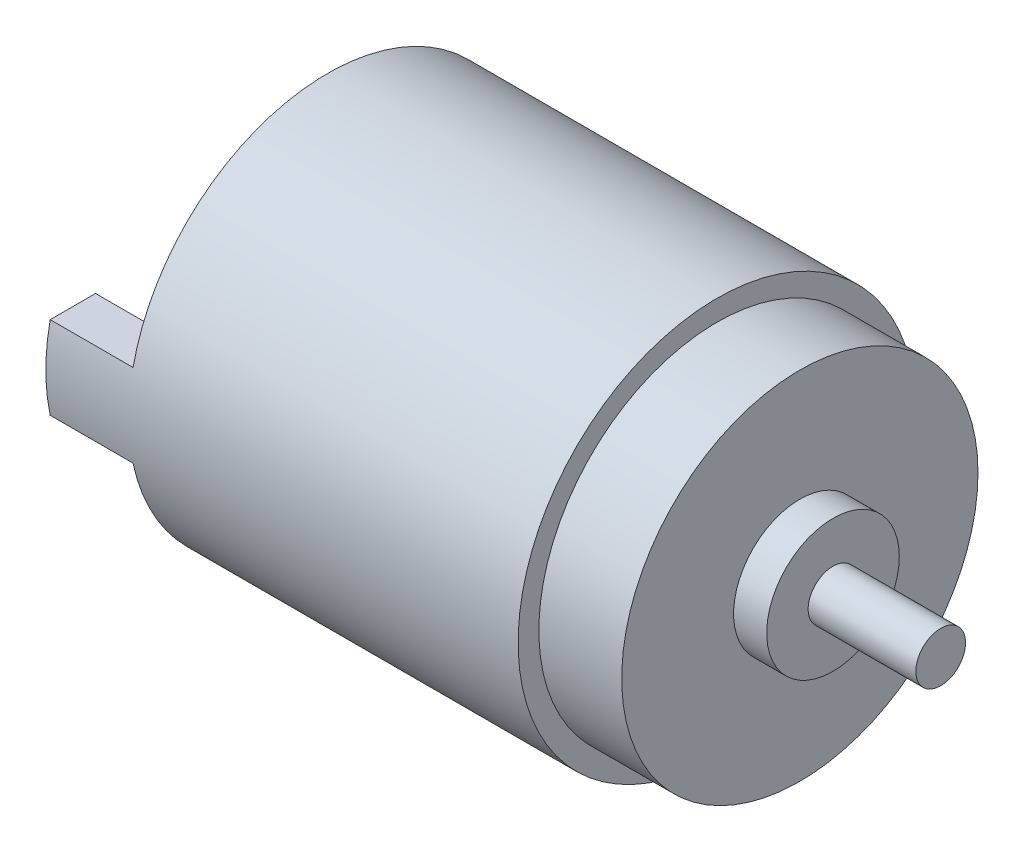
ISO-10303-21;
HEADER;
FILE_DESCRIPTION(('STEP AP214'),'2;1');
FILE_NAME('part.step','',(''),(''),'','','');
FILE_SCHEMA(('AUTOMOTIVE_DESIGN { 1 0 10303 214 1 1 1 1 }'));
ENDSEC;
DATA;
#1=APPLICATION_CONTEXT('core data for automotive mechanical design processes');
#2=APPLICATION_PROTOCOL_DEFINITION('international standard','automotive_design',2000,#1);
#3=PRODUCT_CONTEXT('',#1,'mechanical');
#4=PRODUCT('Part','Part','',(#3));
#5=PRODUCT_RELATED_PRODUCT_CATEGORY('part','',(#4));
#6=PRODUCT_DEFINITION_FORMATION('','',#4);
#7=PRODUCT_DEFINITION_CONTEXT('part definition',#1,'design');
#8=PRODUCT_DEFINITION('design','',#6,#7);
#9=PRODUCT_DEFINITION_SHAPE('','',#8);
#10=(LENGTH_UNIT() NAMED_UNIT(*) SI_UNIT(.MILLI.,.METRE.));
#11=(NAMED_UNIT(*) PLANE_ANGLE_UNIT() SI_UNIT($,.RADIAN.));
#12=(NAMED_UNIT(*) SI_UNIT($,.STERADIAN.) SOLID_ANGLE_UNIT());
#13=UNCERTAINTY_MEASURE_WITH_UNIT(LENGTH_MEASURE(1.E-05),#10,'distance_accuracy_value','');
#14=(GEOMETRIC_REPRESENTATION_CONTEXT(3) GLOBAL_UNCERTAINTY_ASSIGNED_CONTEXT((#13)) GLOBAL_UNIT_ASSIGNED_CONTEXT((#10,
#11,#12)) REPRESENTATION_CONTEXT('',''));
#15=CARTESIAN_POINT('',(0.,0.,0.));
#16=DIRECTION('',(0.,0.,1.));
#17=DIRECTION('',(1.,0.,0.));
#18=AXIS2_PLACEMENT_3D('',#15,#16,#17);
#19=CARTESIAN_POINT('',(0.,0.,0.));
#20=DIRECTION('',(1.,0.,0.));
#21=DIRECTION('',(0.,0.,-1.));
#22=AXIS2_PLACEMENT_3D('',#19,#20,#21);
#23=PLANE('',#22);
#24=CARTESIAN_POINT('',(0.,0.,0.));
#25=DIRECTION('',(-1.,0.,0.));
#26=DIRECTION('',(0.,0.,1.));
#27=AXIS2_PLACEMENT_3D('',#24,#25,#26);
#28=CIRCLE('',#27,4.5);
#29=CARTESIAN_POINT('',(0.,-4.,2.06155281280883));
#30=VERTEX_POINT('',#29);
#31=CARTESIAN_POINT('',(0.,-4.,-2.06155281280883));
#32=VERTEX_POINT('',#31);
#33=EDGE_CURVE('E182',#30,#32,#28,.T.);
#34=ORIENTED_EDGE('',*,*,#33,.F.);
#35=DIRECTION('',(0.,0.,1.));
#36=VECTOR('',#35,1.);
#37=CARTESIAN_POINT('',(0.,-4.,-2.06155281280883));
#38=LINE('',#37,#36);
#39=EDGE_CURVE('E187',#32,#30,#38,.T.);
#40=ORIENTED_EDGE('',*,*,#39,.F.);
#41=EDGE_LOOP('',(#34,#40));
#42=FACE_BOUND('',#41,.T.);
#43=DIRECTION('',(0.,0.,-1.));
#44=VECTOR('',#43,1.);
#45=CARTESIAN_POINT('',(0.,2.5,0.));
#46=LINE('',#45,#44);
#47=CARTESIAN_POINT('',(0.,2.5,-9.));
#48=VERTEX_POINT('',#47);
#49=CARTESIAN_POINT('',(0.,2.5,-11.7366945943055));
#50=VERTEX_POINT('',#49);
#51=EDGE_CURVE('E57',#48,#50,#46,.T.);
#52=ORIENTED_EDGE('',*,*,#51,.F.);
#53=DIRECTION('',(0.,-1.,0.));
#54=VECTOR('',#53,1.);
#55=CARTESIAN_POINT('',(0.,0.,-9.));
#56=LINE('',#55,#54);
#57=CARTESIAN_POINT('',(0.,-2.5,-9.));
#58=VERTEX_POINT('',#57);
#59=EDGE_CURVE('E129',#48,#58,#56,.T.);
#60=ORIENTED_EDGE('',*,*,#59,.T.);
#61=DIRECTION('',(0.,0.,-1.));
#62=VECTOR('',#61,1.);
#63=CARTESIAN_POINT('',(0.,-2.5,0.));
#64=LINE('',#63,#62);
#65=CARTESIAN_POINT('',(0.,-2.5,-11.7366945943055));
#66=VERTEX_POINT('',#65);
#67=EDGE_CURVE('E143',#58,#66,#64,.T.);
#68=ORIENTED_EDGE('',*,*,#67,.T.);
#69=CARTESIAN_POINT('',(0.,0.,0.));
#70=DIRECTION('',(1.,0.,0.));
#71=DIRECTION('',(0.,0.,-1.));
#72=AXIS2_PLACEMENT_3D('',#69,#70,#71);
#73=CIRCLE('',#72,12.);
#74=CARTESIAN_POINT('',(0.,-2.5,11.7366945943055));
#75=VERTEX_POINT('',#74);
#76=EDGE_CURVE('E49',#75,#66,#73,.T.);
#77=ORIENTED_EDGE('',*,*,#76,.F.);
#78=DIRECTION('',(0.,0.,1.));
#79=VECTOR('',#78,1.);
#80=CARTESIAN_POINT('',(0.,-2.5,0.));
#81=LINE('',#80,#79);
#82=CARTESIAN_POINT('',(0.,-2.5,9.));
#83=VERTEX_POINT('',#82);
#84=EDGE_CURVE('E171',#83,#75,#81,.T.);
#85=ORIENTED_EDGE('',*,*,#84,.F.);
#86=DIRECTION('',(0.,-1.,0.));
#87=VECTOR('',#86,1.);
#88=CARTESIAN_POINT('',(0.,0.,9.));
#89=LINE('',#88,#87);
#90=CARTESIAN_POINT('',(0.,2.5,9.));
#91=VERTEX_POINT('',#90);
#92=EDGE_CURVE('E130',#91,#83,#89,.T.);
#93=ORIENTED_EDGE('',*,*,#92,.F.);
#94=DIRECTION('',(0.,0.,1.));
#95=VECTOR('',#94,1.);
#96=CARTESIAN_POINT('',(0.,2.5,0.));
#97=LINE('',#96,#95);
#98=CARTESIAN_POINT('',(0.,2.5,11.7366945943055));
#99=VERTEX_POINT('',#98);
#100=EDGE_CURVE('E161',#91,#99,#97,.T.);
#101=ORIENTED_EDGE('',*,*,#100,.T.);
#102=EDGE_CURVE('E213',#50,#99,#73,.T.);
#103=ORIENTED_EDGE('',*,*,#102,.F.);
#104=EDGE_LOOP('',(#52,#60,#68,#77,#85,#93,#101,#103));
#105=FACE_BOUND('',#104,.T.);
#106=ADVANCED_FACE('F40',(#42,#105),#23,.F.);
#107=CARTESIAN_POINT('',(23.5,0.,0.));
#108=DIRECTION('',(-1.,0.,0.));
#109=DIRECTION('',(0.,0.,1.));
#110=AXIS2_PLACEMENT_3D('',#107,#108,#109);
#111=CYLINDRICAL_SURFACE('',#110,12.);
#112=CARTESIAN_POINT('',(23.5,0.,0.));
#113=DIRECTION('',(1.,0.,0.));
#114=DIRECTION('',(0.,0.,-1.));
#115=AXIS2_PLACEMENT_3D('',#112,#113,#114);
#116=CIRCLE('',#115,12.);
#117=CARTESIAN_POINT('',(23.5,0.,-12.));
#118=VERTEX_POINT('',#117);
#119=EDGE_CURVE('E11',#118,#118,#116,.T.);
#120=ORIENTED_EDGE('',*,*,#119,.F.);
#121=EDGE_LOOP('',(#120));
#122=FACE_BOUND('',#121,.T.);
#123=ORIENTED_EDGE('',*,*,#76,.T.);
#124=DIRECTION('',(1.,0.,0.));
#125=VECTOR('',#124,1.);
#126=CARTESIAN_POINT('',(-5.,-2.5,-11.7366945943055));
#127=LINE('',#126,#125);
#128=CARTESIAN_POINT('',(-5.,-2.5,-11.7366945943055));
#129=VERTEX_POINT('',#128);
#130=EDGE_CURVE('E154',#129,#66,#127,.T.);
#131=ORIENTED_EDGE('',*,*,#130,.F.);
#132=CARTESIAN_POINT('',(-5.,0.,0.));
#133=DIRECTION('',(1.,0.,0.));
#134=DIRECTION('',(0.,0.,-1.));
#135=AXIS2_PLACEMENT_3D('',#132,#133,#134);
#136=CIRCLE('',#135,12.);
#137=CARTESIAN_POINT('',(-5.,2.5,-11.7366945943055));
#138=VERTEX_POINT('',#137);
#139=EDGE_CURVE('E138',#129,#138,#136,.T.);
#140=ORIENTED_EDGE('',*,*,#139,.T.);
#141=DIRECTION('',(1.,0.,0.));
#142=VECTOR('',#141,1.);
#143=CARTESIAN_POINT('',(-5.,2.5,-11.7366945943055));
#144=LINE('',#143,#142);
#145=EDGE_CURVE('E131',#138,#50,#144,.T.);
#146=ORIENTED_EDGE('',*,*,#145,.T.);
#147=ORIENTED_EDGE('',*,*,#102,.T.);
#148=DIRECTION('',(1.,0.,0.));
#149=VECTOR('',#148,1.);
#150=CARTESIAN_POINT('',(-5.,2.5,11.7366945943055));
#151=LINE('',#150,#149);
#152=CARTESIAN_POINT('',(-5.,2.5,11.7366945943055));
#153=VERTEX_POINT('',#152);
#154=EDGE_CURVE('E176',#153,#99,#151,.T.);
#155=ORIENTED_EDGE('',*,*,#154,.F.);
#156=CARTESIAN_POINT('',(-5.,0.,0.));
#157=DIRECTION('',(-1.,0.,0.));
#158=DIRECTION('',(0.,0.,1.));
#159=AXIS2_PLACEMENT_3D('',#156,#157,#158);
#160=CIRCLE('',#159,12.);
#161=CARTESIAN_POINT('',(-5.,-2.5,11.7366945943055));
#162=VERTEX_POINT('',#161);
#163=EDGE_CURVE('E163',#162,#153,#160,.T.);
#164=ORIENTED_EDGE('',*,*,#163,.F.);
#165=DIRECTION('',(1.,0.,0.));
#166=VECTOR('',#165,1.);
#167=CARTESIAN_POINT('',(-5.,-2.5,11.7366945943055));
#168=LINE('',#167,#166);
#169=EDGE_CURVE('E65',#162,#75,#168,.T.);
#170=ORIENTED_EDGE('',*,*,#169,.T.);
#171=EDGE_LOOP('',(#123,#131,#140,#146,#147,#155,#164,#170));
#172=FACE_BOUND('',#171,.T.);
#173=ADVANCED_FACE('F42',(#122,#172),#111,.T.);
#174=CARTESIAN_POINT('',(23.5,0.,0.));
#175=DIRECTION('',(1.,0.,0.));
#176=DIRECTION('',(0.,0.,-1.));
#177=AXIS2_PLACEMENT_3D('',#174,#175,#176);
#178=PLANE('',#177);
#179=CARTESIAN_POINT('',(23.5,0.,0.));
#180=DIRECTION('',(1.,0.,0.));
#181=DIRECTION('',(0.,0.,-1.));
#182=AXIS2_PLACEMENT_3D('',#179,#180,#181);
#183=CIRCLE('',#182,10.75);
#184=CARTESIAN_POINT('',(23.5,0.,-10.75));
#185=VERTEX_POINT('',#184);
#186=EDGE_CURVE('E209',#185,#185,#183,.T.);
#187=ORIENTED_EDGE('',*,*,#186,.F.);
#188=EDGE_LOOP('',(#187));
#189=FACE_BOUND('',#188,.T.);
#190=ORIENTED_EDGE('',*,*,#119,.T.);
#191=EDGE_LOOP('',(#190));
#192=FACE_BOUND('',#191,.T.);
#193=ADVANCED_FACE('F248',(#189,#192),#178,.T.);
#194=CARTESIAN_POINT('',(28.5,0.,0.));
#195=DIRECTION('',(-1.,0.,0.));
#196=DIRECTION('',(0.,0.,1.));
#197=AXIS2_PLACEMENT_3D('',#194,#195,#196);
#198=CYLINDRICAL_SURFACE('',#197,10.75);
#199=CARTESIAN_POINT('',(28.5,0.,0.));
#200=DIRECTION('',(1.,0.,0.));
#201=DIRECTION('',(0.,0.,-1.));
#202=AXIS2_PLACEMENT_3D('',#199,#200,#201);
#203=CIRCLE('',#202,10.75);
#204=CARTESIAN_POINT('',(28.5,0.,-10.75));
#205=VERTEX_POINT('',#204);
#206=EDGE_CURVE('E205',#205,#205,#203,.T.);
#207=ORIENTED_EDGE('',*,*,#206,.F.);
#208=EDGE_LOOP('',(#207));
#209=FACE_BOUND('',#208,.T.);
#210=ORIENTED_EDGE('',*,*,#186,.T.);
#211=EDGE_LOOP('',(#210));
#212=FACE_BOUND('',#211,.T.);
#213=ADVANCED_FACE('F253',(#209,#212),#198,.T.);
#214=CARTESIAN_POINT('',(28.5,0.,0.));
#215=DIRECTION('',(1.,0.,0.));
#216=DIRECTION('',(0.,0.,-1.));
#217=AXIS2_PLACEMENT_3D('',#214,#215,#216);
#218=PLANE('',#217);
#219=CARTESIAN_POINT('',(28.5,0.,0.));
#220=DIRECTION('',(1.,0.,0.));
#221=DIRECTION('',(0.,0.,-1.));
#222=AXIS2_PLACEMENT_3D('',#219,#220,#221);
#223=CIRCLE('',#222,4.);
#224=CARTESIAN_POINT('',(28.5,0.,-4.));
#225=VERTEX_POINT('',#224);
#226=EDGE_CURVE('E199',#225,#225,#223,.T.);
#227=ORIENTED_EDGE('',*,*,#226,.F.);
#228=EDGE_LOOP('',(#227));
#229=FACE_BOUND('',#228,.T.);
#230=ORIENTED_EDGE('',*,*,#206,.T.);
#231=EDGE_LOOP('',(#230));
#232=FACE_BOUND('',#231,.T.);
#233=ADVANCED_FACE('F267',(#229,#232),#218,.T.);
#234=CARTESIAN_POINT('',(30.5,0.,0.));
#235=DIRECTION('',(-1.,0.,0.));
#236=DIRECTION('',(0.,0.,1.));
#237=AXIS2_PLACEMENT_3D('',#234,#235,#236);
#238=CYLINDRICAL_SURFACE('',#237,4.);
#239=CARTESIAN_POINT('',(30.5,0.,0.));
#240=DIRECTION('',(1.,0.,0.));
#241=DIRECTION('',(0.,0.,-1.));
#242=AXIS2_PLACEMENT_3D('',#239,#240,#241);
#243=CIRCLE('',#242,4.);
#244=CARTESIAN_POINT('',(30.5,0.,-4.));
#245=VERTEX_POINT('',#244);
#246=EDGE_CURVE('E200',#245,#245,#243,.T.);
#247=ORIENTED_EDGE('',*,*,#246,.F.);
#248=EDGE_LOOP('',(#247));
#249=FACE_BOUND('',#248,.T.);
#250=ORIENTED_EDGE('',*,*,#226,.T.);
#251=EDGE_LOOP('',(#250));
#252=FACE_BOUND('',#251,.T.);
#253=ADVANCED_FACE('F271',(#249,#252),#238,.T.);
#254=CARTESIAN_POINT('',(30.5,0.,0.));
#255=DIRECTION('',(1.,0.,0.));
#256=DIRECTION('',(0.,0.,-1.));
#257=AXIS2_PLACEMENT_3D('',#254,#255,#256);
#258=PLANE('',#257);
#259=CARTESIAN_POINT('',(30.5,0.,0.));
#260=DIRECTION('',(1.,0.,0.));
#261=DIRECTION('',(0.,0.,-1.));
#262=AXIS2_PLACEMENT_3D('',#259,#260,#261);
#263=CIRCLE('',#262,1.5);
#264=CARTESIAN_POINT('',(30.5,0.,-1.5));
#265=VERTEX_POINT('',#264);
#266=EDGE_CURVE('E44',#265,#265,#263,.T.);
#267=ORIENTED_EDGE('',*,*,#266,.F.);
#268=EDGE_LOOP('',(#267));
#269=FACE_BOUND('',#268,.T.);
#270=ORIENTED_EDGE('',*,*,#246,.T.);
#271=EDGE_LOOP('',(#270));
#272=FACE_BOUND('',#271,.T.);
#273=ADVANCED_FACE('F263',(#269,#272),#258,.T.);
#274=CARTESIAN_POINT('',(37.,0.,0.));
#275=DIRECTION('',(1.,0.,0.));
#276=DIRECTION('',(0.,0.,-1.));
#277=AXIS2_PLACEMENT_3D('',#274,#275,#276);
#278=PLANE('',#277);
#279=CARTESIAN_POINT('',(37.,0.,0.));
#280=DIRECTION('',(1.,0.,0.));
#281=DIRECTION('',(0.,0.,-1.));
#282=AXIS2_PLACEMENT_3D('',#279,#280,#281);
#283=CIRCLE('',#282,1.5);
#284=CARTESIAN_POINT('',(37.,0.,-1.5));
#285=VERTEX_POINT('',#284);
#286=EDGE_CURVE('E208',#285,#285,#283,.T.);
#287=ORIENTED_EDGE('',*,*,#286,.T.);
#288=EDGE_LOOP('',(#287));
#289=FACE_BOUND('',#288,.T.);
#290=ADVANCED_FACE('F259',(#289),#278,.T.);
#291=CARTESIAN_POINT('',(37.,0.,0.));
#292=DIRECTION('',(-1.,0.,0.));
#293=DIRECTION('',(0.,0.,1.));
#294=AXIS2_PLACEMENT_3D('',#291,#292,#293);
#295=CYLINDRICAL_SURFACE('',#294,1.5);
#296=ORIENTED_EDGE('',*,*,#266,.T.);
#297=EDGE_LOOP('',(#296));
#298=FACE_BOUND('',#297,.T.);
#299=ORIENTED_EDGE('',*,*,#286,.F.);
#300=EDGE_LOOP('',(#299));
#301=FACE_BOUND('',#300,.T.);
#302=ADVANCED_FACE('F255',(#298,#301),#295,.T.);
#303=CARTESIAN_POINT('',(-2.,0.,0.));
#304=DIRECTION('',(1.,0.,0.));
#305=DIRECTION('',(0.,0.,-1.));
#306=AXIS2_PLACEMENT_3D('',#303,#304,#305);
#307=CYLINDRICAL_SURFACE('',#306,4.5);
#308=ORIENTED_EDGE('',*,*,#33,.T.);
#309=DIRECTION('',(1.,0.,0.));
#310=VECTOR('',#309,1.);
#311=CARTESIAN_POINT('',(-2.,-4.,-2.06155281280883));
#312=LINE('',#311,#310);
#313=CARTESIAN_POINT('',(-2.,-4.,-2.06155281280883));
#314=VERTEX_POINT('',#313);
#315=EDGE_CURVE('E196',#314,#32,#312,.T.);
#316=ORIENTED_EDGE('',*,*,#315,.F.);
#317=CARTESIAN_POINT('',(-2.,0.,0.));
#318=DIRECTION('',(-1.,0.,0.));
#319=DIRECTION('',(0.,0.,1.));
#320=AXIS2_PLACEMENT_3D('',#317,#318,#319);
#321=CIRCLE('',#320,4.5);
#322=CARTESIAN_POINT('',(-2.,-4.,2.06155281280883));
#323=VERTEX_POINT('',#322);
#324=EDGE_CURVE('E183',#323,#314,#321,.T.);
#325=ORIENTED_EDGE('',*,*,#324,.F.);
#326=DIRECTION('',(1.,0.,0.));
#327=VECTOR('',#326,1.);
#328=CARTESIAN_POINT('',(-2.,-4.,2.06155281280883));
#329=LINE('',#328,#327);
#330=EDGE_CURVE('E189',#323,#30,#329,.T.);
#331=ORIENTED_EDGE('',*,*,#330,.T.);
#332=EDGE_LOOP('',(#308,#316,#325,#331));
#333=FACE_BOUND('',#332,.T.);
#334=ADVANCED_FACE('F258',(#333),#307,.T.);
#335=CARTESIAN_POINT('',(-2.,-4.,-2.06155281280883));
#336=DIRECTION('',(0.,1.,0.));
#337=DIRECTION('',(0.,0.,1.));
#338=AXIS2_PLACEMENT_3D('',#335,#336,#337);
#339=PLANE('',#338);
#340=ORIENTED_EDGE('',*,*,#39,.T.);
#341=ORIENTED_EDGE('',*,*,#330,.F.);
#342=DIRECTION('',(0.,0.,1.));
#343=VECTOR('',#342,1.);
#344=CARTESIAN_POINT('',(-2.,-4.,-2.06155281280883));
#345=LINE('',#344,#343);
#346=EDGE_CURVE('E186',#314,#323,#345,.T.);
#347=ORIENTED_EDGE('',*,*,#346,.F.);
#348=ORIENTED_EDGE('',*,*,#315,.T.);
#349=EDGE_LOOP('',(#340,#341,#347,#348));
#350=FACE_BOUND('',#349,.T.);
#351=ADVANCED_FACE('F281',(#350),#339,.F.);
#352=CARTESIAN_POINT('',(-2.,0.,0.));
#353=DIRECTION('',(-1.,0.,0.));
#354=DIRECTION('',(0.,0.,1.));
#355=AXIS2_PLACEMENT_3D('',#352,#353,#354);
#356=PLANE('',#355);
#357=ORIENTED_EDGE('',*,*,#324,.T.);
#358=ORIENTED_EDGE('',*,*,#346,.T.);
#359=EDGE_LOOP('',(#357,#358));
#360=FACE_BOUND('',#359,.T.);
#361=ADVANCED_FACE('F285',(#360),#356,.T.);
#362=CARTESIAN_POINT('',(-5.,0.,9.));
#363=DIRECTION('',(0.,0.,1.));
#364=DIRECTION('',(1.,0.,0.));
#365=AXIS2_PLACEMENT_3D('',#362,#363,#364);
#366=PLANE('',#365);
#367=ORIENTED_EDGE('',*,*,#92,.T.);
#368=DIRECTION('',(1.,0.,0.));
#369=VECTOR('',#368,1.);
#370=CARTESIAN_POINT('',(-5.,-2.5,9.));
#371=LINE('',#370,#369);
#372=CARTESIAN_POINT('',(-5.,-2.5,9.));
#373=VERTEX_POINT('',#372);
#374=EDGE_CURVE('E180',#373,#83,#371,.T.);
#375=ORIENTED_EDGE('',*,*,#374,.F.);
#376=DIRECTION('',(0.,-1.,0.));
#377=VECTOR('',#376,1.);
#378=CARTESIAN_POINT('',(-5.,0.,9.));
#379=LINE('',#378,#377);
#380=CARTESIAN_POINT('',(-5.,2.5,9.));
#381=VERTEX_POINT('',#380);
#382=EDGE_CURVE('E157',#381,#373,#379,.T.);
#383=ORIENTED_EDGE('',*,*,#382,.F.);
#384=DIRECTION('',(1.,0.,0.));
#385=VECTOR('',#384,1.);
#386=CARTESIAN_POINT('',(-5.,2.5,9.));
#387=LINE('',#386,#385);
#388=EDGE_CURVE('E168',#381,#91,#387,.T.);
#389=ORIENTED_EDGE('',*,*,#388,.T.);
#390=EDGE_LOOP('',(#367,#375,#383,#389));
#391=FACE_BOUND('',#390,.T.);
#392=ADVANCED_FACE('F226',(#391),#366,.F.);
#393=CARTESIAN_POINT('',(-5.,-2.5,0.));
#394=DIRECTION('',(0.,1.,0.));
#395=DIRECTION('',(0.,0.,1.));
#396=AXIS2_PLACEMENT_3D('',#393,#394,#395);
#397=PLANE('',#396);
#398=ORIENTED_EDGE('',*,*,#84,.T.);
#399=ORIENTED_EDGE('',*,*,#169,.F.);
#400=DIRECTION('',(0.,0.,1.));
#401=VECTOR('',#400,1.);
#402=CARTESIAN_POINT('',(-5.,-2.5,0.));
#403=LINE('',#402,#401);
#404=EDGE_CURVE('E160',#373,#162,#403,.T.);
#405=ORIENTED_EDGE('',*,*,#404,.F.);
#406=ORIENTED_EDGE('',*,*,#374,.T.);
#407=EDGE_LOOP('',(#398,#399,#405,#406));
#408=FACE_BOUND('',#407,.T.);
#409=ADVANCED_FACE('F231',(#408),#397,.F.);
#410=CARTESIAN_POINT('',(-5.,2.5,0.));
#411=DIRECTION('',(0.,1.,0.));
#412=DIRECTION('',(0.,0.,1.));
#413=AXIS2_PLACEMENT_3D('',#410,#411,#412);
#414=PLANE('',#413);
#415=ORIENTED_EDGE('',*,*,#100,.F.);
#416=ORIENTED_EDGE('',*,*,#388,.F.);
#417=DIRECTION('',(0.,0.,1.));
#418=VECTOR('',#417,1.);
#419=CARTESIAN_POINT('',(-5.,2.5,0.));
#420=LINE('',#419,#418);
#421=EDGE_CURVE('E165',#381,#153,#420,.T.);
#422=ORIENTED_EDGE('',*,*,#421,.T.);
#423=ORIENTED_EDGE('',*,*,#154,.T.);
#424=EDGE_LOOP('',(#415,#416,#422,#423));
#425=FACE_BOUND('',#424,.T.);
#426=ADVANCED_FACE('F220',(#425),#414,.T.);
#427=CARTESIAN_POINT('',(-5.,0.,0.));
#428=DIRECTION('',(-1.,0.,0.));
#429=DIRECTION('',(0.,0.,1.));
#430=AXIS2_PLACEMENT_3D('',#427,#428,#429);
#431=PLANE('',#430);
#432=ORIENTED_EDGE('',*,*,#382,.T.);
#433=ORIENTED_EDGE('',*,*,#404,.T.);
#434=ORIENTED_EDGE('',*,*,#163,.T.);
#435=ORIENTED_EDGE('',*,*,#421,.F.);
#436=EDGE_LOOP('',(#432,#433,#434,#435));
#437=FACE_BOUND('',#436,.T.);
#438=ADVANCED_FACE('F229',(#437),#431,.T.);
#439=CARTESIAN_POINT('',(-5.,0.,-9.));
#440=DIRECTION('',(0.,0.,1.));
#441=DIRECTION('',(1.,0.,0.));
#442=AXIS2_PLACEMENT_3D('',#439,#440,#441);
#443=PLANE('',#442);
#444=ORIENTED_EDGE('',*,*,#59,.F.);
#445=DIRECTION('',(1.,0.,0.));
#446=VECTOR('',#445,1.);
#447=CARTESIAN_POINT('',(-5.,2.5,-9.));
#448=LINE('',#447,#446);
#449=CARTESIAN_POINT('',(-5.,2.5,-9.));
#450=VERTEX_POINT('',#449);
#451=EDGE_CURVE('E122',#450,#48,#448,.T.);
#452=ORIENTED_EDGE('',*,*,#451,.F.);
#453=DIRECTION('',(0.,-1.,0.));
#454=VECTOR('',#453,1.);
#455=CARTESIAN_POINT('',(-5.,0.,-9.));
#456=LINE('',#455,#454);
#457=CARTESIAN_POINT('',(-5.,-2.5,-9.));
#458=VERTEX_POINT('',#457);
#459=EDGE_CURVE('E126',#450,#458,#456,.T.);
#460=ORIENTED_EDGE('',*,*,#459,.T.);
#461=DIRECTION('',(1.,0.,0.));
#462=VECTOR('',#461,1.);
#463=CARTESIAN_POINT('',(-5.,-2.5,-9.));
#464=LINE('',#463,#462);
#465=EDGE_CURVE('E150',#458,#58,#464,.T.);
#466=ORIENTED_EDGE('',*,*,#465,.T.);
#467=EDGE_LOOP('',(#444,#452,#460,#466));
#468=FACE_BOUND('',#467,.T.);
#469=ADVANCED_FACE('F124',(#468),#443,.T.);
#470=CARTESIAN_POINT('',(-5.,2.5,0.));
#471=DIRECTION('',(0.,-1.,0.));
#472=DIRECTION('',(0.,0.,-1.));
#473=AXIS2_PLACEMENT_3D('',#470,#471,#472);
#474=PLANE('',#473);
#475=ORIENTED_EDGE('',*,*,#51,.T.);
#476=ORIENTED_EDGE('',*,*,#145,.F.);
#477=DIRECTION('',(0.,0.,-1.));
#478=VECTOR('',#477,1.);
#479=CARTESIAN_POINT('',(-5.,2.5,0.));
#480=LINE('',#479,#478);
#481=EDGE_CURVE('E133',#450,#138,#480,.T.);
#482=ORIENTED_EDGE('',*,*,#481,.F.);
#483=ORIENTED_EDGE('',*,*,#451,.T.);
#484=EDGE_LOOP('',(#475,#476,#482,#483));
#485=FACE_BOUND('',#484,.T.);
#486=ADVANCED_FACE('F134',(#485),#474,.F.);
#487=CARTESIAN_POINT('',(-5.,-2.5,0.));
#488=DIRECTION('',(0.,-1.,0.));
#489=DIRECTION('',(0.,0.,-1.));
#490=AXIS2_PLACEMENT_3D('',#487,#488,#489);
#491=PLANE('',#490);
#492=ORIENTED_EDGE('',*,*,#67,.F.);
#493=ORIENTED_EDGE('',*,*,#465,.F.);
#494=DIRECTION('',(0.,0.,-1.));
#495=VECTOR('',#494,1.);
#496=CARTESIAN_POINT('',(-5.,-2.5,0.));
#497=LINE('',#496,#495);
#498=EDGE_CURVE('E142',#458,#129,#497,.T.);
#499=ORIENTED_EDGE('',*,*,#498,.T.);
#500=ORIENTED_EDGE('',*,*,#130,.T.);
#501=EDGE_LOOP('',(#492,#493,#499,#500));
#502=FACE_BOUND('',#501,.T.);
#503=ADVANCED_FACE('F234',(#502),#491,.T.);
#504=CARTESIAN_POINT('',(-5.,0.,0.));
#505=DIRECTION('',(-1.,0.,0.));
#506=DIRECTION('',(0.,0.,-1.));
#507=AXIS2_PLACEMENT_3D('',#504,#505,#506);
#508=PLANE('',#507);
#509=ORIENTED_EDGE('',*,*,#459,.F.);
#510=ORIENTED_EDGE('',*,*,#481,.T.);
#511=ORIENTED_EDGE('',*,*,#139,.F.);
#512=ORIENTED_EDGE('',*,*,#498,.F.);
#513=EDGE_LOOP('',(#509,#510,#511,#512));
#514=FACE_BOUND('',#513,.T.);
#515=ADVANCED_FACE('F140',(#514),#508,.T.);
#516=CLOSED_SHELL('',(#106,#173,#193,#213,#233,#253,#273,#290,#302,#334,#351,#361,#392,#409,
#426,#438,#469,#486,#503,#515));
#517=MANIFOLD_SOLID_BREP('B2',#516);
#518=ADVANCED_BREP_SHAPE_REPRESENTATION('',(#18,#517),#14);
#519=SHAPE_DEFINITION_REPRESENTATION(#9,#518);
ENDSEC;
END-ISO-10303-21;
